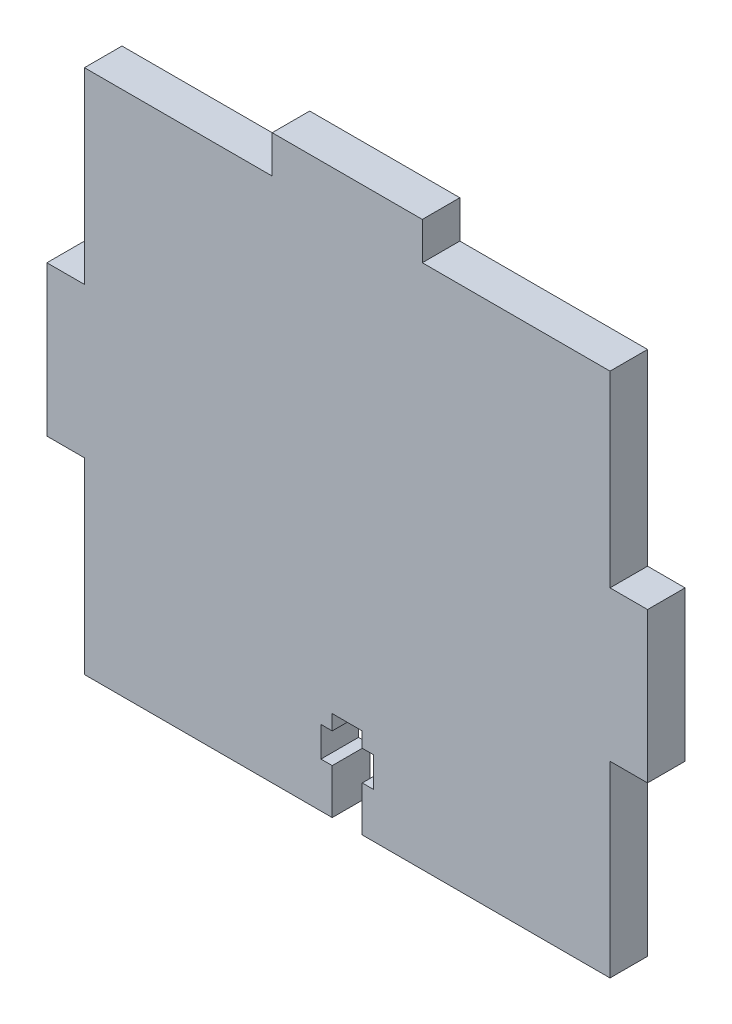
ISO-10303-21;
HEADER;
FILE_DESCRIPTION(('STEP AP214'),'2;1');
FILE_NAME('part.step','',(''),(''),'','','');
FILE_SCHEMA(('AUTOMOTIVE_DESIGN { 1 0 10303 214 1 1 1 1 }'));
ENDSEC;
DATA;
#1=APPLICATION_CONTEXT('core data for automotive mechanical design processes');
#2=APPLICATION_PROTOCOL_DEFINITION('international standard','automotive_design',2000,#1);
#3=PRODUCT_CONTEXT('',#1,'mechanical');
#4=PRODUCT('Part','Part','',(#3));
#5=PRODUCT_RELATED_PRODUCT_CATEGORY('part','',(#4));
#6=PRODUCT_DEFINITION_FORMATION('','',#4);
#7=PRODUCT_DEFINITION_CONTEXT('part definition',#1,'design');
#8=PRODUCT_DEFINITION('design','',#6,#7);
#9=PRODUCT_DEFINITION_SHAPE('','',#8);
#10=(LENGTH_UNIT() NAMED_UNIT(*) SI_UNIT(.MILLI.,.METRE.));
#11=(NAMED_UNIT(*) PLANE_ANGLE_UNIT() SI_UNIT($,.RADIAN.));
#12=(NAMED_UNIT(*) SI_UNIT($,.STERADIAN.) SOLID_ANGLE_UNIT());
#13=UNCERTAINTY_MEASURE_WITH_UNIT(LENGTH_MEASURE(1.E-05),#10,'distance_accuracy_value','');
#14=(GEOMETRIC_REPRESENTATION_CONTEXT(3) GLOBAL_UNCERTAINTY_ASSIGNED_CONTEXT((#13)) GLOBAL_UNIT_ASSIGNED_CONTEXT((#10,
#11,#12)) REPRESENTATION_CONTEXT('',''));
#15=CARTESIAN_POINT('',(0.,0.,0.));
#16=DIRECTION('',(0.,0.,1.));
#17=DIRECTION('',(1.,0.,0.));
#18=AXIS2_PLACEMENT_3D('',#15,#16,#17);
#19=CARTESIAN_POINT('',(-35.,-35.,5.));
#20=DIRECTION('',(0.,1.,0.));
#21=DIRECTION('',(0.,0.,1.));
#22=AXIS2_PLACEMENT_3D('',#19,#20,#21);
#23=PLANE('',#22);
#24=DIRECTION('',(1.,0.,0.));
#25=VECTOR('',#24,1.);
#26=CARTESIAN_POINT('',(-35.,-35.,0.));
#27=LINE('',#26,#25);
#28=CARTESIAN_POINT('',(-35.,-35.,0.));
#29=VERTEX_POINT('',#28);
#30=CARTESIAN_POINT('',(-1.99999999999999,-35.,0.));
#31=VERTEX_POINT('',#30);
#32=EDGE_CURVE('E227',#29,#31,#27,.T.);
#33=ORIENTED_EDGE('',*,*,#32,.T.);
#34=DIRECTION('',(0.,0.,1.));
#35=VECTOR('',#34,1.);
#36=CARTESIAN_POINT('',(-1.99999999999999,-35.,-5.));
#37=LINE('',#36,#35);
#38=CARTESIAN_POINT('',(-1.99999999999999,-35.,5.));
#39=VERTEX_POINT('',#38);
#40=EDGE_CURVE('E200',#31,#39,#37,.T.);
#41=ORIENTED_EDGE('',*,*,#40,.T.);
#42=DIRECTION('',(1.,0.,0.));
#43=VECTOR('',#42,1.);
#44=CARTESIAN_POINT('',(-35.,-35.,5.));
#45=LINE('',#44,#43);
#46=CARTESIAN_POINT('',(-35.,-35.,5.));
#47=VERTEX_POINT('',#46);
#48=EDGE_CURVE('E191',#47,#39,#45,.T.);
#49=ORIENTED_EDGE('',*,*,#48,.F.);
#50=DIRECTION('',(0.,0.,-1.));
#51=VECTOR('',#50,1.);
#52=CARTESIAN_POINT('',(-35.,-35.,5.));
#53=LINE('',#52,#51);
#54=EDGE_CURVE('E185',#47,#29,#53,.T.);
#55=ORIENTED_EDGE('',*,*,#54,.T.);
#56=EDGE_LOOP('',(#33,#41,#49,#55));
#57=FACE_BOUND('',#56,.T.);
#58=ADVANCED_FACE('F33',(#57),#23,.F.);
#59=CARTESIAN_POINT('',(35.,-10.,5.));
#60=DIRECTION('',(-1.,0.,0.));
#61=DIRECTION('',(0.,0.,1.));
#62=AXIS2_PLACEMENT_3D('',#59,#60,#61);
#63=PLANE('',#62);
#64=DIRECTION('',(0.,1.,0.));
#65=VECTOR('',#64,1.);
#66=CARTESIAN_POINT('',(35.,-10.,0.));
#67=LINE('',#66,#65);
#68=CARTESIAN_POINT('',(35.,-35.,0.));
#69=VERTEX_POINT('',#68);
#70=CARTESIAN_POINT('',(35.,-10.,0.));
#71=VERTEX_POINT('',#70);
#72=EDGE_CURVE('E196',#69,#71,#67,.T.);
#73=ORIENTED_EDGE('',*,*,#72,.T.);
#74=DIRECTION('',(0.,0.,-1.));
#75=VECTOR('',#74,1.);
#76=CARTESIAN_POINT('',(35.,-10.,5.));
#77=LINE('',#76,#75);
#78=CARTESIAN_POINT('',(35.,-10.,5.));
#79=VERTEX_POINT('',#78);
#80=EDGE_CURVE('E267',#79,#71,#77,.T.);
#81=ORIENTED_EDGE('',*,*,#80,.F.);
#82=DIRECTION('',(0.,1.,0.));
#83=VECTOR('',#82,1.);
#84=CARTESIAN_POINT('',(35.,-10.,5.));
#85=LINE('',#84,#83);
#86=CARTESIAN_POINT('',(35.,-35.,5.));
#87=VERTEX_POINT('',#86);
#88=EDGE_CURVE('E230',#87,#79,#85,.T.);
#89=ORIENTED_EDGE('',*,*,#88,.F.);
#90=DIRECTION('',(0.,0.,-1.));
#91=VECTOR('',#90,1.);
#92=CARTESIAN_POINT('',(35.,-35.,5.));
#93=LINE('',#92,#91);
#94=EDGE_CURVE('E195',#87,#69,#93,.T.);
#95=ORIENTED_EDGE('',*,*,#94,.T.);
#96=EDGE_LOOP('',(#73,#81,#89,#95));
#97=FACE_BOUND('',#96,.T.);
#98=ADVANCED_FACE('F35',(#97),#63,.F.);
#99=CARTESIAN_POINT('',(35.,-10.,5.));
#100=DIRECTION('',(-6.4174360270286E-12,1.,0.));
#101=DIRECTION('',(-1.,-6.4174360270286E-12,0.));
#102=AXIS2_PLACEMENT_3D('',#99,#100,#101);
#103=PLANE('',#102);
#104=DIRECTION('',(1.,6.41743602702859E-12,0.));
#105=VECTOR('',#104,1.);
#106=CARTESIAN_POINT('',(35.,-10.,0.));
#107=LINE('',#106,#105);
#108=CARTESIAN_POINT('',(40.,-9.99999999996792,0.));
#109=VERTEX_POINT('',#108);
#110=EDGE_CURVE('E199',#71,#109,#107,.T.);
#111=ORIENTED_EDGE('',*,*,#110,.T.);
#112=DIRECTION('',(0.,0.,-1.));
#113=VECTOR('',#112,1.);
#114=CARTESIAN_POINT('',(40.,-9.99999999996792,5.));
#115=LINE('',#114,#113);
#116=CARTESIAN_POINT('',(40.,-9.99999999996792,5.));
#117=VERTEX_POINT('',#116);
#118=EDGE_CURVE('E264',#117,#109,#115,.T.);
#119=ORIENTED_EDGE('',*,*,#118,.F.);
#120=DIRECTION('',(1.,6.41743602702859E-12,0.));
#121=VECTOR('',#120,1.);
#122=CARTESIAN_POINT('',(35.,-10.,5.));
#123=LINE('',#122,#121);
#124=EDGE_CURVE('E124',#79,#117,#123,.T.);
#125=ORIENTED_EDGE('',*,*,#124,.F.);
#126=ORIENTED_EDGE('',*,*,#80,.T.);
#127=EDGE_LOOP('',(#111,#119,#125,#126));
#128=FACE_BOUND('',#127,.T.);
#129=ADVANCED_FACE('F483',(#128),#103,.F.);
#130=CARTESIAN_POINT('',(40.,10.,5.));
#131=DIRECTION('',(-1.,0.,0.));
#132=DIRECTION('',(0.,-1.,0.));
#133=AXIS2_PLACEMENT_3D('',#130,#131,#132);
#134=PLANE('',#133);
#135=DIRECTION('',(0.,1.,0.));
#136=VECTOR('',#135,1.);
#137=CARTESIAN_POINT('',(40.,10.,0.));
#138=LINE('',#137,#136);
#139=CARTESIAN_POINT('',(40.,10.,0.));
#140=VERTEX_POINT('',#139);
#141=EDGE_CURVE('E202',#109,#140,#138,.T.);
#142=ORIENTED_EDGE('',*,*,#141,.T.);
#143=DIRECTION('',(0.,0.,-1.));
#144=VECTOR('',#143,1.);
#145=CARTESIAN_POINT('',(40.,10.,5.));
#146=LINE('',#145,#144);
#147=CARTESIAN_POINT('',(40.,10.,5.));
#148=VERTEX_POINT('',#147);
#149=EDGE_CURVE('E261',#148,#140,#146,.T.);
#150=ORIENTED_EDGE('',*,*,#149,.F.);
#151=DIRECTION('',(0.,1.,0.));
#152=VECTOR('',#151,1.);
#153=CARTESIAN_POINT('',(40.,10.,5.));
#154=LINE('',#153,#152);
#155=EDGE_CURVE('E355',#117,#148,#154,.T.);
#156=ORIENTED_EDGE('',*,*,#155,.F.);
#157=ORIENTED_EDGE('',*,*,#118,.T.);
#158=EDGE_LOOP('',(#142,#150,#156,#157));
#159=FACE_BOUND('',#158,.T.);
#160=ADVANCED_FACE('F486',(#159),#134,.F.);
#161=CARTESIAN_POINT('',(35.,10.,5.));
#162=DIRECTION('',(0.,-1.,0.));
#163=DIRECTION('',(1.,0.,0.));
#164=AXIS2_PLACEMENT_3D('',#161,#162,#163);
#165=PLANE('',#164);
#166=DIRECTION('',(-1.,0.,0.));
#167=VECTOR('',#166,1.);
#168=CARTESIAN_POINT('',(35.,10.,0.));
#169=LINE('',#168,#167);
#170=CARTESIAN_POINT('',(35.,10.,0.));
#171=VERTEX_POINT('',#170);
#172=EDGE_CURVE('E204',#140,#171,#169,.T.);
#173=ORIENTED_EDGE('',*,*,#172,.T.);
#174=DIRECTION('',(0.,0.,-1.));
#175=VECTOR('',#174,1.);
#176=CARTESIAN_POINT('',(35.,10.,5.));
#177=LINE('',#176,#175);
#178=CARTESIAN_POINT('',(35.,10.,5.));
#179=VERTEX_POINT('',#178);
#180=EDGE_CURVE('E258',#179,#171,#177,.T.);
#181=ORIENTED_EDGE('',*,*,#180,.F.);
#182=DIRECTION('',(-1.,0.,0.));
#183=VECTOR('',#182,1.);
#184=CARTESIAN_POINT('',(35.,10.,5.));
#185=LINE('',#184,#183);
#186=EDGE_CURVE('E357',#148,#179,#185,.T.);
#187=ORIENTED_EDGE('',*,*,#186,.F.);
#188=ORIENTED_EDGE('',*,*,#149,.T.);
#189=EDGE_LOOP('',(#173,#181,#187,#188));
#190=FACE_BOUND('',#189,.T.);
#191=ADVANCED_FACE('F491',(#190),#165,.F.);
#192=CARTESIAN_POINT('',(35.,35.,5.));
#193=DIRECTION('',(-1.,0.,0.));
#194=DIRECTION('',(0.,0.,1.));
#195=AXIS2_PLACEMENT_3D('',#192,#193,#194);
#196=PLANE('',#195);
#197=DIRECTION('',(0.,1.,0.));
#198=VECTOR('',#197,1.);
#199=CARTESIAN_POINT('',(35.,35.,0.));
#200=LINE('',#199,#198);
#201=CARTESIAN_POINT('',(35.,35.,0.));
#202=VERTEX_POINT('',#201);
#203=EDGE_CURVE('E206',#171,#202,#200,.T.);
#204=ORIENTED_EDGE('',*,*,#203,.T.);
#205=DIRECTION('',(0.,0.,-1.));
#206=VECTOR('',#205,1.);
#207=CARTESIAN_POINT('',(35.,35.,5.));
#208=LINE('',#207,#206);
#209=CARTESIAN_POINT('',(35.,35.,5.));
#210=VERTEX_POINT('',#209);
#211=EDGE_CURVE('E255',#210,#202,#208,.T.);
#212=ORIENTED_EDGE('',*,*,#211,.F.);
#213=DIRECTION('',(0.,1.,0.));
#214=VECTOR('',#213,1.);
#215=CARTESIAN_POINT('',(35.,35.,5.));
#216=LINE('',#215,#214);
#217=EDGE_CURVE('E359',#179,#210,#216,.T.);
#218=ORIENTED_EDGE('',*,*,#217,.F.);
#219=ORIENTED_EDGE('',*,*,#180,.T.);
#220=EDGE_LOOP('',(#204,#212,#218,#219));
#221=FACE_BOUND('',#220,.T.);
#222=ADVANCED_FACE('F497',(#221),#196,.F.);
#223=CARTESIAN_POINT('',(9.99999999999999,35.,5.));
#224=DIRECTION('',(0.,-1.,0.));
#225=DIRECTION('',(1.,0.,0.));
#226=AXIS2_PLACEMENT_3D('',#223,#224,#225);
#227=PLANE('',#226);
#228=DIRECTION('',(-1.,0.,0.));
#229=VECTOR('',#228,1.);
#230=CARTESIAN_POINT('',(9.99999999999999,35.,0.));
#231=LINE('',#230,#229);
#232=CARTESIAN_POINT('',(9.99999999999999,35.,0.));
#233=VERTEX_POINT('',#232);
#234=EDGE_CURVE('E208',#202,#233,#231,.T.);
#235=ORIENTED_EDGE('',*,*,#234,.T.);
#236=DIRECTION('',(0.,0.,-1.));
#237=VECTOR('',#236,1.);
#238=CARTESIAN_POINT('',(9.99999999999999,35.,5.));
#239=LINE('',#238,#237);
#240=CARTESIAN_POINT('',(9.99999999999999,35.,5.));
#241=VERTEX_POINT('',#240);
#242=EDGE_CURVE('E252',#241,#233,#239,.T.);
#243=ORIENTED_EDGE('',*,*,#242,.F.);
#244=DIRECTION('',(-1.,0.,0.));
#245=VECTOR('',#244,1.);
#246=CARTESIAN_POINT('',(9.99999999999999,35.,5.));
#247=LINE('',#246,#245);
#248=EDGE_CURVE('E361',#210,#241,#247,.T.);
#249=ORIENTED_EDGE('',*,*,#248,.F.);
#250=ORIENTED_EDGE('',*,*,#211,.T.);
#251=EDGE_LOOP('',(#235,#243,#249,#250));
#252=FACE_BOUND('',#251,.T.);
#253=ADVANCED_FACE('F501',(#252),#227,.F.);
#254=CARTESIAN_POINT('',(9.99999999999999,35.,5.));
#255=DIRECTION('',(-1.,-6.41466046946704E-12,0.));
#256=DIRECTION('',(6.41466046946704E-12,-1.,0.));
#257=AXIS2_PLACEMENT_3D('',#254,#255,#256);
#258=PLANE('',#257);
#259=DIRECTION('',(-6.41466046946704E-12,1.,0.));
#260=VECTOR('',#259,1.);
#261=CARTESIAN_POINT('',(9.99999999999999,35.,0.));
#262=LINE('',#261,#260);
#263=CARTESIAN_POINT('',(9.99999999996792,40.,0.));
#264=VERTEX_POINT('',#263);
#265=EDGE_CURVE('E210',#233,#264,#262,.T.);
#266=ORIENTED_EDGE('',*,*,#265,.T.);
#267=DIRECTION('',(0.,0.,-1.));
#268=VECTOR('',#267,1.);
#269=CARTESIAN_POINT('',(9.99999999996792,40.,5.));
#270=LINE('',#269,#268);
#271=CARTESIAN_POINT('',(9.99999999996792,40.,5.));
#272=VERTEX_POINT('',#271);
#273=EDGE_CURVE('E249',#272,#264,#270,.T.);
#274=ORIENTED_EDGE('',*,*,#273,.F.);
#275=DIRECTION('',(-6.41466046946704E-12,1.,0.));
#276=VECTOR('',#275,1.);
#277=CARTESIAN_POINT('',(9.99999999999999,35.,5.));
#278=LINE('',#277,#276);
#279=EDGE_CURVE('E363',#241,#272,#278,.T.);
#280=ORIENTED_EDGE('',*,*,#279,.F.);
#281=ORIENTED_EDGE('',*,*,#242,.T.);
#282=EDGE_LOOP('',(#266,#274,#280,#281));
#283=FACE_BOUND('',#282,.T.);
#284=ADVANCED_FACE('F506',(#283),#258,.F.);
#285=CARTESIAN_POINT('',(-10.,40.,5.));
#286=DIRECTION('',(0.,-1.,0.));
#287=DIRECTION('',(1.,0.,0.));
#288=AXIS2_PLACEMENT_3D('',#285,#286,#287);
#289=PLANE('',#288);
#290=DIRECTION('',(-1.,0.,0.));
#291=VECTOR('',#290,1.);
#292=CARTESIAN_POINT('',(-10.,40.,0.));
#293=LINE('',#292,#291);
#294=CARTESIAN_POINT('',(-10.,40.,0.));
#295=VERTEX_POINT('',#294);
#296=EDGE_CURVE('E212',#264,#295,#293,.T.);
#297=ORIENTED_EDGE('',*,*,#296,.T.);
#298=DIRECTION('',(0.,0.,-1.));
#299=VECTOR('',#298,1.);
#300=CARTESIAN_POINT('',(-10.,40.,5.));
#301=LINE('',#300,#299);
#302=CARTESIAN_POINT('',(-10.,40.,5.));
#303=VERTEX_POINT('',#302);
#304=EDGE_CURVE('E246',#303,#295,#301,.T.);
#305=ORIENTED_EDGE('',*,*,#304,.F.);
#306=DIRECTION('',(-1.,0.,0.));
#307=VECTOR('',#306,1.);
#308=CARTESIAN_POINT('',(-10.,40.,5.));
#309=LINE('',#308,#307);
#310=EDGE_CURVE('E365',#272,#303,#309,.T.);
#311=ORIENTED_EDGE('',*,*,#310,.F.);
#312=ORIENTED_EDGE('',*,*,#273,.T.);
#313=EDGE_LOOP('',(#297,#305,#311,#312));
#314=FACE_BOUND('',#313,.T.);
#315=ADVANCED_FACE('F512',(#314),#289,.F.);
#316=CARTESIAN_POINT('',(-10.,35.,5.));
#317=DIRECTION('',(1.,0.,0.));
#318=DIRECTION('',(0.,1.,0.));
#319=AXIS2_PLACEMENT_3D('',#316,#317,#318);
#320=PLANE('',#319);
#321=DIRECTION('',(0.,-1.,0.));
#322=VECTOR('',#321,1.);
#323=CARTESIAN_POINT('',(-10.,35.,0.));
#324=LINE('',#323,#322);
#325=CARTESIAN_POINT('',(-10.,35.,0.));
#326=VERTEX_POINT('',#325);
#327=EDGE_CURVE('E214',#295,#326,#324,.T.);
#328=ORIENTED_EDGE('',*,*,#327,.T.);
#329=DIRECTION('',(0.,0.,-1.));
#330=VECTOR('',#329,1.);
#331=CARTESIAN_POINT('',(-10.,35.,5.));
#332=LINE('',#331,#330);
#333=CARTESIAN_POINT('',(-10.,35.,5.));
#334=VERTEX_POINT('',#333);
#335=EDGE_CURVE('E243',#334,#326,#332,.T.);
#336=ORIENTED_EDGE('',*,*,#335,.F.);
#337=DIRECTION('',(0.,-1.,0.));
#338=VECTOR('',#337,1.);
#339=CARTESIAN_POINT('',(-10.,35.,5.));
#340=LINE('',#339,#338);
#341=EDGE_CURVE('E367',#303,#334,#340,.T.);
#342=ORIENTED_EDGE('',*,*,#341,.F.);
#343=ORIENTED_EDGE('',*,*,#304,.T.);
#344=EDGE_LOOP('',(#328,#336,#342,#343));
#345=FACE_BOUND('',#344,.T.);
#346=ADVANCED_FACE('F516',(#345),#320,.F.);
#347=CARTESIAN_POINT('',(-35.,35.,5.));
#348=DIRECTION('',(0.,-1.,0.));
#349=DIRECTION('',(1.,0.,0.));
#350=AXIS2_PLACEMENT_3D('',#347,#348,#349);
#351=PLANE('',#350);
#352=DIRECTION('',(-1.,0.,0.));
#353=VECTOR('',#352,1.);
#354=CARTESIAN_POINT('',(-35.,35.,0.));
#355=LINE('',#354,#353);
#356=CARTESIAN_POINT('',(-35.,35.,0.));
#357=VERTEX_POINT('',#356);
#358=EDGE_CURVE('E216',#326,#357,#355,.T.);
#359=ORIENTED_EDGE('',*,*,#358,.T.);
#360=DIRECTION('',(0.,0.,-1.));
#361=VECTOR('',#360,1.);
#362=CARTESIAN_POINT('',(-35.,35.,5.));
#363=LINE('',#362,#361);
#364=CARTESIAN_POINT('',(-35.,35.,5.));
#365=VERTEX_POINT('',#364);
#366=EDGE_CURVE('E240',#365,#357,#363,.T.);
#367=ORIENTED_EDGE('',*,*,#366,.F.);
#368=DIRECTION('',(-1.,0.,0.));
#369=VECTOR('',#368,1.);
#370=CARTESIAN_POINT('',(-35.,35.,5.));
#371=LINE('',#370,#369);
#372=EDGE_CURVE('E369',#334,#365,#371,.T.);
#373=ORIENTED_EDGE('',*,*,#372,.F.);
#374=ORIENTED_EDGE('',*,*,#335,.T.);
#375=EDGE_LOOP('',(#359,#367,#373,#374));
#376=FACE_BOUND('',#375,.T.);
#377=ADVANCED_FACE('F521',(#376),#351,.F.);
#378=CARTESIAN_POINT('',(-35.,35.,5.));
#379=DIRECTION('',(1.,0.,0.));
#380=DIRECTION('',(0.,0.,-1.));
#381=AXIS2_PLACEMENT_3D('',#378,#379,#380);
#382=PLANE('',#381);
#383=DIRECTION('',(0.,-1.,0.));
#384=VECTOR('',#383,1.);
#385=CARTESIAN_POINT('',(-35.,35.,0.));
#386=LINE('',#385,#384);
#387=CARTESIAN_POINT('',(-35.,10.,0.));
#388=VERTEX_POINT('',#387);
#389=EDGE_CURVE('E218',#357,#388,#386,.T.);
#390=ORIENTED_EDGE('',*,*,#389,.T.);
#391=DIRECTION('',(0.,0.,-1.));
#392=VECTOR('',#391,1.);
#393=CARTESIAN_POINT('',(-35.,10.,5.));
#394=LINE('',#393,#392);
#395=CARTESIAN_POINT('',(-35.,10.,5.));
#396=VERTEX_POINT('',#395);
#397=EDGE_CURVE('E237',#396,#388,#394,.T.);
#398=ORIENTED_EDGE('',*,*,#397,.F.);
#399=DIRECTION('',(0.,-1.,0.));
#400=VECTOR('',#399,1.);
#401=CARTESIAN_POINT('',(-35.,35.,5.));
#402=LINE('',#401,#400);
#403=EDGE_CURVE('E371',#365,#396,#402,.T.);
#404=ORIENTED_EDGE('',*,*,#403,.F.);
#405=ORIENTED_EDGE('',*,*,#366,.T.);
#406=EDGE_LOOP('',(#390,#398,#404,#405));
#407=FACE_BOUND('',#406,.T.);
#408=ADVANCED_FACE('F524',(#407),#382,.F.);
#409=CARTESIAN_POINT('',(-35.,10.,5.));
#410=DIRECTION('',(6.42125241867574E-12,-1.,0.));
#411=DIRECTION('',(1.,6.42125241867574E-12,0.));
#412=AXIS2_PLACEMENT_3D('',#409,#410,#411);
#413=PLANE('',#412);
#414=DIRECTION('',(-1.,-6.42125241867574E-12,0.));
#415=VECTOR('',#414,1.);
#416=CARTESIAN_POINT('',(-35.,10.,0.));
#417=LINE('',#416,#415);
#418=CARTESIAN_POINT('',(-40.,9.9999999999679,0.));
#419=VERTEX_POINT('',#418);
#420=EDGE_CURVE('E220',#388,#419,#417,.T.);
#421=ORIENTED_EDGE('',*,*,#420,.T.);
#422=DIRECTION('',(0.,0.,-1.));
#423=VECTOR('',#422,1.);
#424=CARTESIAN_POINT('',(-40.,9.9999999999679,5.));
#425=LINE('',#424,#423);
#426=CARTESIAN_POINT('',(-40.,9.9999999999679,5.));
#427=VERTEX_POINT('',#426);
#428=EDGE_CURVE('E234',#427,#419,#425,.T.);
#429=ORIENTED_EDGE('',*,*,#428,.F.);
#430=DIRECTION('',(-1.,-6.42125241867574E-12,0.));
#431=VECTOR('',#430,1.);
#432=CARTESIAN_POINT('',(-35.,10.,5.));
#433=LINE('',#432,#431);
#434=EDGE_CURVE('E373',#396,#427,#433,.T.);
#435=ORIENTED_EDGE('',*,*,#434,.F.);
#436=ORIENTED_EDGE('',*,*,#397,.T.);
#437=EDGE_LOOP('',(#421,#429,#435,#436));
#438=FACE_BOUND('',#437,.T.);
#439=ADVANCED_FACE('F379',(#438),#413,.F.);
#440=CARTESIAN_POINT('',(-40.,-10.,5.));
#441=DIRECTION('',(1.,0.,0.));
#442=DIRECTION('',(0.,0.,-1.));
#443=AXIS2_PLACEMENT_3D('',#440,#441,#442);
#444=PLANE('',#443);
#445=DIRECTION('',(0.,-1.,0.));
#446=VECTOR('',#445,1.);
#447=CARTESIAN_POINT('',(-40.,-10.,0.));
#448=LINE('',#447,#446);
#449=CARTESIAN_POINT('',(-40.,-10.,0.));
#450=VERTEX_POINT('',#449);
#451=EDGE_CURVE('E222',#419,#450,#448,.T.);
#452=ORIENTED_EDGE('',*,*,#451,.T.);
#453=DIRECTION('',(0.,0.,-1.));
#454=VECTOR('',#453,1.);
#455=CARTESIAN_POINT('',(-40.,-10.,5.));
#456=LINE('',#455,#454);
#457=CARTESIAN_POINT('',(-40.,-10.,5.));
#458=VERTEX_POINT('',#457);
#459=EDGE_CURVE('E184',#458,#450,#456,.T.);
#460=ORIENTED_EDGE('',*,*,#459,.F.);
#461=DIRECTION('',(0.,-1.,0.));
#462=VECTOR('',#461,1.);
#463=CARTESIAN_POINT('',(-40.,-10.,5.));
#464=LINE('',#463,#462);
#465=EDGE_CURVE('E172',#427,#458,#464,.T.);
#466=ORIENTED_EDGE('',*,*,#465,.F.);
#467=ORIENTED_EDGE('',*,*,#428,.T.);
#468=EDGE_LOOP('',(#452,#460,#466,#467));
#469=FACE_BOUND('',#468,.T.);
#470=ADVANCED_FACE('F383',(#469),#444,.F.);
#471=CARTESIAN_POINT('',(-35.,-10.,5.));
#472=DIRECTION('',(0.,1.,0.));
#473=DIRECTION('',(0.,0.,1.));
#474=AXIS2_PLACEMENT_3D('',#471,#472,#473);
#475=PLANE('',#474);
#476=DIRECTION('',(1.,0.,0.));
#477=VECTOR('',#476,1.);
#478=CARTESIAN_POINT('',(-35.,-10.,0.));
#479=LINE('',#478,#477);
#480=CARTESIAN_POINT('',(-35.,-10.,0.));
#481=VERTEX_POINT('',#480);
#482=EDGE_CURVE('E181',#450,#481,#479,.T.);
#483=ORIENTED_EDGE('',*,*,#482,.T.);
#484=DIRECTION('',(0.,0.,-1.));
#485=VECTOR('',#484,1.);
#486=CARTESIAN_POINT('',(-35.,-10.,5.));
#487=LINE('',#486,#485);
#488=CARTESIAN_POINT('',(-35.,-10.,5.));
#489=VERTEX_POINT('',#488);
#490=EDGE_CURVE('E178',#489,#481,#487,.T.);
#491=ORIENTED_EDGE('',*,*,#490,.F.);
#492=DIRECTION('',(1.,0.,0.));
#493=VECTOR('',#492,1.);
#494=CARTESIAN_POINT('',(-35.,-10.,5.));
#495=LINE('',#494,#493);
#496=EDGE_CURVE('E163',#458,#489,#495,.T.);
#497=ORIENTED_EDGE('',*,*,#496,.F.);
#498=ORIENTED_EDGE('',*,*,#459,.T.);
#499=EDGE_LOOP('',(#483,#491,#497,#498));
#500=FACE_BOUND('',#499,.T.);
#501=ADVANCED_FACE('F179',(#500),#475,.F.);
#502=CARTESIAN_POINT('',(-35.,-10.,5.));
#503=DIRECTION('',(1.,0.,0.));
#504=DIRECTION('',(0.,1.,0.));
#505=AXIS2_PLACEMENT_3D('',#502,#503,#504);
#506=PLANE('',#505);
#507=DIRECTION('',(0.,-1.,0.));
#508=VECTOR('',#507,1.);
#509=CARTESIAN_POINT('',(-35.,-10.,0.));
#510=LINE('',#509,#508);
#511=EDGE_CURVE('E225',#481,#29,#510,.T.);
#512=ORIENTED_EDGE('',*,*,#511,.T.);
#513=ORIENTED_EDGE('',*,*,#54,.F.);
#514=DIRECTION('',(0.,-1.,0.));
#515=VECTOR('',#514,1.);
#516=CARTESIAN_POINT('',(-35.,-10.,5.));
#517=LINE('',#516,#515);
#518=EDGE_CURVE('E169',#489,#47,#517,.T.);
#519=ORIENTED_EDGE('',*,*,#518,.F.);
#520=ORIENTED_EDGE('',*,*,#490,.T.);
#521=EDGE_LOOP('',(#512,#513,#519,#520));
#522=FACE_BOUND('',#521,.T.);
#523=ADVANCED_FACE('F187',(#522),#506,.F.);
#524=CARTESIAN_POINT('',(2.00000000000001,-35.,5.));
#525=VERTEX_POINT('',#524);
#526=EDGE_CURVE('E57',#525,#87,#45,.T.);
#527=ORIENTED_EDGE('',*,*,#526,.F.);
#528=DIRECTION('',(0.,0.,1.));
#529=VECTOR('',#528,1.);
#530=CARTESIAN_POINT('',(2.00000000000001,-35.,-5.));
#531=LINE('',#530,#529);
#532=CARTESIAN_POINT('',(2.00000000000001,-35.,0.));
#533=VERTEX_POINT('',#532);
#534=EDGE_CURVE('E349',#533,#525,#531,.T.);
#535=ORIENTED_EDGE('',*,*,#534,.F.);
#536=EDGE_CURVE('E115',#533,#69,#27,.T.);
#537=ORIENTED_EDGE('',*,*,#536,.T.);
#538=ORIENTED_EDGE('',*,*,#94,.F.);
#539=EDGE_LOOP('',(#527,#535,#537,#538));
#540=FACE_BOUND('',#539,.T.);
#541=ADVANCED_FACE('F476',(#540),#23,.F.);
#542=CARTESIAN_POINT('',(0.,0.,5.));
#543=DIRECTION('',(0.,0.,1.));
#544=DIRECTION('',(1.,0.,0.));
#545=AXIS2_PLACEMENT_3D('',#542,#543,#544);
#546=PLANE('',#545);
#547=DIRECTION('',(0.,-1.,0.));
#548=VECTOR('',#547,1.);
#549=CARTESIAN_POINT('',(-1.99999999999999,-35.,5.));
#550=LINE('',#549,#548);
#551=CARTESIAN_POINT('',(-1.99999999999999,-29.,5.));
#552=VERTEX_POINT('',#551);
#553=EDGE_CURVE('E352',#552,#39,#550,.T.);
#554=ORIENTED_EDGE('',*,*,#553,.F.);
#555=DIRECTION('',(1.,0.,0.));
#556=VECTOR('',#555,1.);
#557=CARTESIAN_POINT('',(-1.99999999999999,-29.,5.));
#558=LINE('',#557,#556);
#559=CARTESIAN_POINT('',(-3.49999999999999,-29.,5.));
#560=VERTEX_POINT('',#559);
#561=EDGE_CURVE('E454',#560,#552,#558,.T.);
#562=ORIENTED_EDGE('',*,*,#561,.F.);
#563=DIRECTION('',(0.,-1.,0.));
#564=VECTOR('',#563,1.);
#565=CARTESIAN_POINT('',(-3.49999999999999,-29.,5.));
#566=LINE('',#565,#564);
#567=CARTESIAN_POINT('',(-3.49999999999999,-25.,5.));
#568=VERTEX_POINT('',#567);
#569=EDGE_CURVE('E322',#568,#560,#566,.T.);
#570=ORIENTED_EDGE('',*,*,#569,.F.);
#571=DIRECTION('',(-1.,0.,0.));
#572=VECTOR('',#571,1.);
#573=CARTESIAN_POINT('',(-3.49999999999999,-25.,5.));
#574=LINE('',#573,#572);
#575=CARTESIAN_POINT('',(-1.99999999999999,-25.,5.));
#576=VERTEX_POINT('',#575);
#577=EDGE_CURVE('E448',#576,#568,#574,.T.);
#578=ORIENTED_EDGE('',*,*,#577,.F.);
#579=DIRECTION('',(0.,-1.,0.));
#580=VECTOR('',#579,1.);
#581=CARTESIAN_POINT('',(-1.99999999999999,-25.,5.));
#582=LINE('',#581,#580);
#583=CARTESIAN_POINT('',(-1.99999999999999,-23.,5.));
#584=VERTEX_POINT('',#583);
#585=EDGE_CURVE('E425',#584,#576,#582,.T.);
#586=ORIENTED_EDGE('',*,*,#585,.F.);
#587=DIRECTION('',(-1.,0.,0.));
#588=VECTOR('',#587,1.);
#589=CARTESIAN_POINT('',(-1.99999999999999,-23.,5.));
#590=LINE('',#589,#588);
#591=CARTESIAN_POINT('',(2.00000000000001,-23.,5.));
#592=VERTEX_POINT('',#591);
#593=EDGE_CURVE('E444',#592,#584,#590,.T.);
#594=ORIENTED_EDGE('',*,*,#593,.F.);
#595=DIRECTION('',(0.,1.,0.));
#596=VECTOR('',#595,1.);
#597=CARTESIAN_POINT('',(2.00000000000001,-23.,5.));
#598=LINE('',#597,#596);
#599=CARTESIAN_POINT('',(2.00000000000001,-25.,5.));
#600=VERTEX_POINT('',#599);
#601=EDGE_CURVE('E437',#600,#592,#598,.T.);
#602=ORIENTED_EDGE('',*,*,#601,.F.);
#603=DIRECTION('',(-1.,0.,0.));
#604=VECTOR('',#603,1.);
#605=CARTESIAN_POINT('',(2.00000000000001,-25.,5.));
#606=LINE('',#605,#604);
#607=CARTESIAN_POINT('',(3.50000000000001,-25.,5.));
#608=VERTEX_POINT('',#607);
#609=EDGE_CURVE('E445',#608,#600,#606,.T.);
#610=ORIENTED_EDGE('',*,*,#609,.F.);
#611=DIRECTION('',(0.,1.,0.));
#612=VECTOR('',#611,1.);
#613=CARTESIAN_POINT('',(3.50000000000001,-25.,5.));
#614=LINE('',#613,#612);
#615=CARTESIAN_POINT('',(3.50000000000001,-29.,5.));
#616=VERTEX_POINT('',#615);
#617=EDGE_CURVE('E532',#616,#608,#614,.T.);
#618=ORIENTED_EDGE('',*,*,#617,.F.);
#619=DIRECTION('',(1.,0.,0.));
#620=VECTOR('',#619,1.);
#621=CARTESIAN_POINT('',(3.50000000000001,-29.,5.));
#622=LINE('',#621,#620);
#623=CARTESIAN_POINT('',(2.00000000000001,-29.,5.));
#624=VERTEX_POINT('',#623);
#625=EDGE_CURVE('E474',#624,#616,#622,.T.);
#626=ORIENTED_EDGE('',*,*,#625,.F.);
#627=DIRECTION('',(0.,1.,0.));
#628=VECTOR('',#627,1.);
#629=CARTESIAN_POINT('',(2.00000000000001,-29.,5.));
#630=LINE('',#629,#628);
#631=EDGE_CURVE('E470',#525,#624,#630,.T.);
#632=ORIENTED_EDGE('',*,*,#631,.F.);
#633=ORIENTED_EDGE('',*,*,#526,.T.);
#634=ORIENTED_EDGE('',*,*,#88,.T.);
#635=ORIENTED_EDGE('',*,*,#124,.T.);
#636=ORIENTED_EDGE('',*,*,#155,.T.);
#637=ORIENTED_EDGE('',*,*,#186,.T.);
#638=ORIENTED_EDGE('',*,*,#217,.T.);
#639=ORIENTED_EDGE('',*,*,#248,.T.);
#640=ORIENTED_EDGE('',*,*,#279,.T.);
#641=ORIENTED_EDGE('',*,*,#310,.T.);
#642=ORIENTED_EDGE('',*,*,#341,.T.);
#643=ORIENTED_EDGE('',*,*,#372,.T.);
#644=ORIENTED_EDGE('',*,*,#403,.T.);
#645=ORIENTED_EDGE('',*,*,#434,.T.);
#646=ORIENTED_EDGE('',*,*,#465,.T.);
#647=ORIENTED_EDGE('',*,*,#496,.T.);
#648=ORIENTED_EDGE('',*,*,#518,.T.);
#649=ORIENTED_EDGE('',*,*,#48,.T.);
#650=EDGE_LOOP('',(#554,#562,#570,#578,#586,#594,#602,#610,#618,#626,#632,#633,#634,#635,#636,
#637,#638,#639,#640,#641,#642,#643,#644,#645,#646,#647,#648,#649));
#651=FACE_BOUND('',#650,.T.);
#652=ADVANCED_FACE('F166',(#651),#546,.T.);
#653=CARTESIAN_POINT('',(0.,0.,0.));
#654=DIRECTION('',(0.,0.,1.));
#655=DIRECTION('',(1.,0.,0.));
#656=AXIS2_PLACEMENT_3D('',#653,#654,#655);
#657=PLANE('',#656);
#658=DIRECTION('',(1.,0.,0.));
#659=VECTOR('',#658,1.);
#660=CARTESIAN_POINT('',(0.,-29.,0.));
#661=LINE('',#660,#659);
#662=CARTESIAN_POINT('',(-3.49999999999999,-29.,0.));
#663=VERTEX_POINT('',#662);
#664=CARTESIAN_POINT('',(-1.99999999999999,-29.,0.));
#665=VERTEX_POINT('',#664);
#666=EDGE_CURVE('E41',#663,#665,#661,.T.);
#667=ORIENTED_EDGE('',*,*,#666,.T.);
#668=DIRECTION('',(0.,-1.,0.));
#669=VECTOR('',#668,1.);
#670=CARTESIAN_POINT('',(-1.99999999999999,0.,0.));
#671=LINE('',#670,#669);
#672=EDGE_CURVE('E11',#665,#31,#671,.T.);
#673=ORIENTED_EDGE('',*,*,#672,.T.);
#674=ORIENTED_EDGE('',*,*,#32,.F.);
#675=ORIENTED_EDGE('',*,*,#511,.F.);
#676=ORIENTED_EDGE('',*,*,#482,.F.);
#677=ORIENTED_EDGE('',*,*,#451,.F.);
#678=ORIENTED_EDGE('',*,*,#420,.F.);
#679=ORIENTED_EDGE('',*,*,#389,.F.);
#680=ORIENTED_EDGE('',*,*,#358,.F.);
#681=ORIENTED_EDGE('',*,*,#327,.F.);
#682=ORIENTED_EDGE('',*,*,#296,.F.);
#683=ORIENTED_EDGE('',*,*,#265,.F.);
#684=ORIENTED_EDGE('',*,*,#234,.F.);
#685=ORIENTED_EDGE('',*,*,#203,.F.);
#686=ORIENTED_EDGE('',*,*,#172,.F.);
#687=ORIENTED_EDGE('',*,*,#141,.F.);
#688=ORIENTED_EDGE('',*,*,#110,.F.);
#689=ORIENTED_EDGE('',*,*,#72,.F.);
#690=ORIENTED_EDGE('',*,*,#536,.F.);
#691=DIRECTION('',(0.,1.,0.));
#692=VECTOR('',#691,1.);
#693=CARTESIAN_POINT('',(2.,0.,0.));
#694=LINE('',#693,#692);
#695=CARTESIAN_POINT('',(2.00000000000001,-29.,0.));
#696=VERTEX_POINT('',#695);
#697=EDGE_CURVE('E269',#533,#696,#694,.T.);
#698=ORIENTED_EDGE('',*,*,#697,.T.);
#699=DIRECTION('',(1.,0.,0.));
#700=VECTOR('',#699,1.);
#701=CARTESIAN_POINT('',(0.,-29.,0.));
#702=LINE('',#701,#700);
#703=CARTESIAN_POINT('',(3.50000000000001,-29.,0.));
#704=VERTEX_POINT('',#703);
#705=EDGE_CURVE('E272',#696,#704,#702,.T.);
#706=ORIENTED_EDGE('',*,*,#705,.T.);
#707=DIRECTION('',(0.,1.,0.));
#708=VECTOR('',#707,1.);
#709=CARTESIAN_POINT('',(3.5,0.,0.));
#710=LINE('',#709,#708);
#711=CARTESIAN_POINT('',(3.50000000000001,-25.,0.));
#712=VERTEX_POINT('',#711);
#713=EDGE_CURVE('E275',#704,#712,#710,.T.);
#714=ORIENTED_EDGE('',*,*,#713,.T.);
#715=DIRECTION('',(-1.,0.,0.));
#716=VECTOR('',#715,1.);
#717=CARTESIAN_POINT('',(0.,-25.,0.));
#718=LINE('',#717,#716);
#719=CARTESIAN_POINT('',(2.00000000000001,-25.,0.));
#720=VERTEX_POINT('',#719);
#721=EDGE_CURVE('E278',#712,#720,#718,.T.);
#722=ORIENTED_EDGE('',*,*,#721,.T.);
#723=DIRECTION('',(0.,1.,0.));
#724=VECTOR('',#723,1.);
#725=CARTESIAN_POINT('',(2.00000000000001,0.,0.));
#726=LINE('',#725,#724);
#727=CARTESIAN_POINT('',(2.00000000000001,-23.,0.));
#728=VERTEX_POINT('',#727);
#729=EDGE_CURVE('E281',#720,#728,#726,.T.);
#730=ORIENTED_EDGE('',*,*,#729,.T.);
#731=DIRECTION('',(-1.,0.,0.));
#732=VECTOR('',#731,1.);
#733=CARTESIAN_POINT('',(0.,-23.,0.));
#734=LINE('',#733,#732);
#735=CARTESIAN_POINT('',(-1.99999999999999,-23.,0.));
#736=VERTEX_POINT('',#735);
#737=EDGE_CURVE('E284',#728,#736,#734,.T.);
#738=ORIENTED_EDGE('',*,*,#737,.T.);
#739=DIRECTION('',(0.,-1.,0.));
#740=VECTOR('',#739,1.);
#741=CARTESIAN_POINT('',(-2.00000000000001,0.,0.));
#742=LINE('',#741,#740);
#743=CARTESIAN_POINT('',(-1.99999999999999,-25.,0.));
#744=VERTEX_POINT('',#743);
#745=EDGE_CURVE('E287',#736,#744,#742,.T.);
#746=ORIENTED_EDGE('',*,*,#745,.T.);
#747=DIRECTION('',(-1.,0.,0.));
#748=VECTOR('',#747,1.);
#749=CARTESIAN_POINT('',(0.,-25.,0.));
#750=LINE('',#749,#748);
#751=CARTESIAN_POINT('',(-3.49999999999999,-25.,0.));
#752=VERTEX_POINT('',#751);
#753=EDGE_CURVE('E290',#744,#752,#750,.T.);
#754=ORIENTED_EDGE('',*,*,#753,.T.);
#755=DIRECTION('',(0.,-1.,0.));
#756=VECTOR('',#755,1.);
#757=CARTESIAN_POINT('',(-3.49999999999999,0.,0.));
#758=LINE('',#757,#756);
#759=EDGE_CURVE('E293',#752,#663,#758,.T.);
#760=ORIENTED_EDGE('',*,*,#759,.T.);
#761=EDGE_LOOP('',(#667,#673,#674,#675,#676,#677,#678,#679,#680,#681,#682,#683,#684,#685,#686,
#687,#688,#689,#690,#698,#706,#714,#722,#730,#738,#746,#754,#760));
#762=FACE_BOUND('',#761,.T.);
#763=ADVANCED_FACE('F299',(#762),#657,.F.);
#764=CARTESIAN_POINT('',(-1.99999999999999,-35.,-5.));
#765=DIRECTION('',(-1.,0.,0.));
#766=DIRECTION('',(0.,0.,1.));
#767=AXIS2_PLACEMENT_3D('',#764,#765,#766);
#768=PLANE('',#767);
#769=DIRECTION('',(0.,0.,1.));
#770=VECTOR('',#769,1.);
#771=CARTESIAN_POINT('',(-1.99999999999999,-29.,-5.));
#772=LINE('',#771,#770);
#773=EDGE_CURVE('E314',#665,#552,#772,.T.);
#774=ORIENTED_EDGE('',*,*,#773,.T.);
#775=ORIENTED_EDGE('',*,*,#553,.T.);
#776=ORIENTED_EDGE('',*,*,#40,.F.);
#777=ORIENTED_EDGE('',*,*,#672,.F.);
#778=EDGE_LOOP('',(#774,#775,#776,#777));
#779=FACE_BOUND('',#778,.T.);
#780=ADVANCED_FACE('F665',(#779),#768,.F.);
#781=CARTESIAN_POINT('',(-1.99999999999999,-29.,-5.));
#782=DIRECTION('',(0.,-1.,0.));
#783=DIRECTION('',(0.,0.,-1.));
#784=AXIS2_PLACEMENT_3D('',#781,#782,#783);
#785=PLANE('',#784);
#786=DIRECTION('',(0.,0.,1.));
#787=VECTOR('',#786,1.);
#788=CARTESIAN_POINT('',(-3.49999999999999,-29.,-5.));
#789=LINE('',#788,#787);
#790=EDGE_CURVE('E311',#663,#560,#789,.T.);
#791=ORIENTED_EDGE('',*,*,#790,.T.);
#792=ORIENTED_EDGE('',*,*,#561,.T.);
#793=ORIENTED_EDGE('',*,*,#773,.F.);
#794=ORIENTED_EDGE('',*,*,#666,.F.);
#795=EDGE_LOOP('',(#791,#792,#793,#794));
#796=FACE_BOUND('',#795,.T.);
#797=ADVANCED_FACE('F308',(#796),#785,.F.);
#798=CARTESIAN_POINT('',(-3.49999999999999,-29.,-5.));
#799=DIRECTION('',(-1.,0.,0.));
#800=DIRECTION('',(0.,0.,1.));
#801=AXIS2_PLACEMENT_3D('',#798,#799,#800);
#802=PLANE('',#801);
#803=DIRECTION('',(0.,0.,1.));
#804=VECTOR('',#803,1.);
#805=CARTESIAN_POINT('',(-3.49999999999999,-25.,-5.));
#806=LINE('',#805,#804);
#807=EDGE_CURVE('E324',#752,#568,#806,.T.);
#808=ORIENTED_EDGE('',*,*,#807,.T.);
#809=ORIENTED_EDGE('',*,*,#569,.T.);
#810=ORIENTED_EDGE('',*,*,#790,.F.);
#811=ORIENTED_EDGE('',*,*,#759,.F.);
#812=EDGE_LOOP('',(#808,#809,#810,#811));
#813=FACE_BOUND('',#812,.T.);
#814=ADVANCED_FACE('F319',(#813),#802,.F.);
#815=CARTESIAN_POINT('',(-3.49999999999999,-25.,-5.));
#816=DIRECTION('',(0.,1.,0.));
#817=DIRECTION('',(0.,0.,1.));
#818=AXIS2_PLACEMENT_3D('',#815,#816,#817);
#819=PLANE('',#818);
#820=DIRECTION('',(0.,0.,1.));
#821=VECTOR('',#820,1.);
#822=CARTESIAN_POINT('',(-1.99999999999999,-25.,-5.));
#823=LINE('',#822,#821);
#824=EDGE_CURVE('E327',#744,#576,#823,.T.);
#825=ORIENTED_EDGE('',*,*,#824,.T.);
#826=ORIENTED_EDGE('',*,*,#577,.T.);
#827=ORIENTED_EDGE('',*,*,#807,.F.);
#828=ORIENTED_EDGE('',*,*,#753,.F.);
#829=EDGE_LOOP('',(#825,#826,#827,#828));
#830=FACE_BOUND('',#829,.T.);
#831=ADVANCED_FACE('F417',(#830),#819,.F.);
#832=CARTESIAN_POINT('',(-1.99999999999999,-25.,-5.));
#833=DIRECTION('',(-1.,0.,0.));
#834=DIRECTION('',(0.,-1.,0.));
#835=AXIS2_PLACEMENT_3D('',#832,#833,#834);
#836=PLANE('',#835);
#837=DIRECTION('',(0.,0.,1.));
#838=VECTOR('',#837,1.);
#839=CARTESIAN_POINT('',(-1.99999999999999,-23.,-5.));
#840=LINE('',#839,#838);
#841=EDGE_CURVE('E333',#736,#584,#840,.T.);
#842=ORIENTED_EDGE('',*,*,#841,.T.);
#843=ORIENTED_EDGE('',*,*,#585,.T.);
#844=ORIENTED_EDGE('',*,*,#824,.F.);
#845=ORIENTED_EDGE('',*,*,#745,.F.);
#846=EDGE_LOOP('',(#842,#843,#844,#845));
#847=FACE_BOUND('',#846,.T.);
#848=ADVANCED_FACE('F422',(#847),#836,.F.);
#849=CARTESIAN_POINT('',(-1.99999999999999,-23.,-5.));
#850=DIRECTION('',(0.,1.,0.));
#851=DIRECTION('',(0.,0.,1.));
#852=AXIS2_PLACEMENT_3D('',#849,#850,#851);
#853=PLANE('',#852);
#854=DIRECTION('',(0.,0.,1.));
#855=VECTOR('',#854,1.);
#856=CARTESIAN_POINT('',(2.00000000000001,-23.,-5.));
#857=LINE('',#856,#855);
#858=EDGE_CURVE('E336',#728,#592,#857,.T.);
#859=ORIENTED_EDGE('',*,*,#858,.T.);
#860=ORIENTED_EDGE('',*,*,#593,.T.);
#861=ORIENTED_EDGE('',*,*,#841,.F.);
#862=ORIENTED_EDGE('',*,*,#737,.F.);
#863=EDGE_LOOP('',(#859,#860,#861,#862));
#864=FACE_BOUND('',#863,.T.);
#865=ADVANCED_FACE('F429',(#864),#853,.F.);
#866=CARTESIAN_POINT('',(2.00000000000001,-23.,-5.));
#867=DIRECTION('',(1.,0.,0.));
#868=DIRECTION('',(0.,1.,0.));
#869=AXIS2_PLACEMENT_3D('',#866,#867,#868);
#870=PLANE('',#869);
#871=DIRECTION('',(0.,0.,1.));
#872=VECTOR('',#871,1.);
#873=CARTESIAN_POINT('',(2.00000000000001,-25.,-5.));
#874=LINE('',#873,#872);
#875=EDGE_CURVE('E339',#720,#600,#874,.T.);
#876=ORIENTED_EDGE('',*,*,#875,.T.);
#877=ORIENTED_EDGE('',*,*,#601,.T.);
#878=ORIENTED_EDGE('',*,*,#858,.F.);
#879=ORIENTED_EDGE('',*,*,#729,.F.);
#880=EDGE_LOOP('',(#876,#877,#878,#879));
#881=FACE_BOUND('',#880,.T.);
#882=ADVANCED_FACE('F434',(#881),#870,.F.);
#883=CARTESIAN_POINT('',(2.00000000000001,-25.,-5.));
#884=DIRECTION('',(0.,1.,0.));
#885=DIRECTION('',(0.,0.,1.));
#886=AXIS2_PLACEMENT_3D('',#883,#884,#885);
#887=PLANE('',#886);
#888=DIRECTION('',(0.,0.,1.));
#889=VECTOR('',#888,1.);
#890=CARTESIAN_POINT('',(3.50000000000001,-25.,-5.));
#891=LINE('',#890,#889);
#892=EDGE_CURVE('E342',#712,#608,#891,.T.);
#893=ORIENTED_EDGE('',*,*,#892,.T.);
#894=ORIENTED_EDGE('',*,*,#609,.T.);
#895=ORIENTED_EDGE('',*,*,#875,.F.);
#896=ORIENTED_EDGE('',*,*,#721,.F.);
#897=EDGE_LOOP('',(#893,#894,#895,#896));
#898=FACE_BOUND('',#897,.T.);
#899=ADVANCED_FACE('F534',(#898),#887,.F.);
#900=CARTESIAN_POINT('',(3.50000000000001,-25.,-5.));
#901=DIRECTION('',(1.,0.,0.));
#902=DIRECTION('',(0.,1.,0.));
#903=AXIS2_PLACEMENT_3D('',#900,#901,#902);
#904=PLANE('',#903);
#905=DIRECTION('',(0.,0.,1.));
#906=VECTOR('',#905,1.);
#907=CARTESIAN_POINT('',(3.50000000000001,-29.,-5.));
#908=LINE('',#907,#906);
#909=EDGE_CURVE('E345',#704,#616,#908,.T.);
#910=ORIENTED_EDGE('',*,*,#909,.T.);
#911=ORIENTED_EDGE('',*,*,#617,.T.);
#912=ORIENTED_EDGE('',*,*,#892,.F.);
#913=ORIENTED_EDGE('',*,*,#713,.F.);
#914=EDGE_LOOP('',(#910,#911,#912,#913));
#915=FACE_BOUND('',#914,.T.);
#916=ADVANCED_FACE('F530',(#915),#904,.F.);
#917=CARTESIAN_POINT('',(3.50000000000001,-29.,-5.));
#918=DIRECTION('',(0.,-1.,0.));
#919=DIRECTION('',(0.,0.,-1.));
#920=AXIS2_PLACEMENT_3D('',#917,#918,#919);
#921=PLANE('',#920);
#922=DIRECTION('',(0.,0.,1.));
#923=VECTOR('',#922,1.);
#924=CARTESIAN_POINT('',(2.00000000000001,-29.,-5.));
#925=LINE('',#924,#923);
#926=EDGE_CURVE('E48',#696,#624,#925,.T.);
#927=ORIENTED_EDGE('',*,*,#926,.T.);
#928=ORIENTED_EDGE('',*,*,#625,.T.);
#929=ORIENTED_EDGE('',*,*,#909,.F.);
#930=ORIENTED_EDGE('',*,*,#705,.F.);
#931=EDGE_LOOP('',(#927,#928,#929,#930));
#932=FACE_BOUND('',#931,.T.);
#933=ADVANCED_FACE('F527',(#932),#921,.F.);
#934=CARTESIAN_POINT('',(2.00000000000001,-29.,-5.));
#935=DIRECTION('',(1.,0.,0.));
#936=DIRECTION('',(0.,1.,0.));
#937=AXIS2_PLACEMENT_3D('',#934,#935,#936);
#938=PLANE('',#937);
#939=ORIENTED_EDGE('',*,*,#534,.T.);
#940=ORIENTED_EDGE('',*,*,#631,.T.);
#941=ORIENTED_EDGE('',*,*,#926,.F.);
#942=ORIENTED_EDGE('',*,*,#697,.F.);
#943=EDGE_LOOP('',(#939,#940,#941,#942));
#944=FACE_BOUND('',#943,.T.);
#945=ADVANCED_FACE('F469',(#944),#938,.F.);
#946=CLOSED_SHELL('',(#58,#98,#129,#160,#191,#222,#253,#284,#315,#346,#377,#408,#439,#470,#501,
#523,#541,#652,#763,#780,#797,#814,#831,#848,#865,#882,#899,#916,#933,#945));
#947=MANIFOLD_SOLID_BREP('B2',#946);
#948=ADVANCED_BREP_SHAPE_REPRESENTATION('',(#18,#947),#14);
#949=SHAPE_DEFINITION_REPRESENTATION(#9,#948);
ENDSEC;
END-ISO-10303-21;
